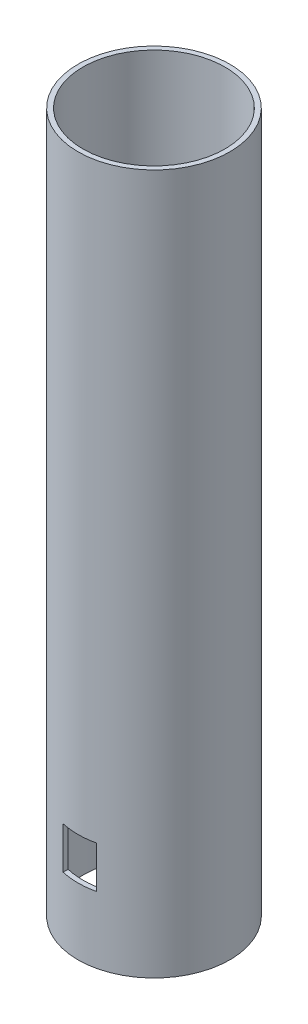
ISO-10303-21;
HEADER;
FILE_DESCRIPTION(('STEP AP214'),'2;1');
FILE_NAME('part.step','',(''),(''),'','','');
FILE_SCHEMA(('AUTOMOTIVE_DESIGN { 1 0 10303 214 1 1 1 1 }'));
ENDSEC;
DATA;
#1=APPLICATION_CONTEXT('core data for automotive mechanical design processes');
#2=APPLICATION_PROTOCOL_DEFINITION('international standard','automotive_design',2000,#1);
#3=PRODUCT_CONTEXT('',#1,'mechanical');
#4=PRODUCT('Part','Part','',(#3));
#5=PRODUCT_RELATED_PRODUCT_CATEGORY('part','',(#4));
#6=PRODUCT_DEFINITION_FORMATION('','',#4);
#7=PRODUCT_DEFINITION_CONTEXT('part definition',#1,'design');
#8=PRODUCT_DEFINITION('design','',#6,#7);
#9=PRODUCT_DEFINITION_SHAPE('','',#8);
#10=(LENGTH_UNIT() NAMED_UNIT(*) SI_UNIT(.MILLI.,.METRE.));
#11=(NAMED_UNIT(*) PLANE_ANGLE_UNIT() SI_UNIT($,.RADIAN.));
#12=(NAMED_UNIT(*) SI_UNIT($,.STERADIAN.) SOLID_ANGLE_UNIT());
#13=UNCERTAINTY_MEASURE_WITH_UNIT(LENGTH_MEASURE(1.E-05),#10,'distance_accuracy_value','');
#14=(GEOMETRIC_REPRESENTATION_CONTEXT(3) GLOBAL_UNCERTAINTY_ASSIGNED_CONTEXT((#13)) GLOBAL_UNIT_ASSIGNED_CONTEXT((#10,
#11,#12)) REPRESENTATION_CONTEXT('',''));
#15=CARTESIAN_POINT('',(0.,0.,0.));
#16=DIRECTION('',(0.,0.,1.));
#17=DIRECTION('',(1.,0.,0.));
#18=AXIS2_PLACEMENT_3D('',#15,#16,#17);
#19=CARTESIAN_POINT('',(0.,125.,0.));
#20=DIRECTION('',(0.,1.,0.));
#21=DIRECTION('',(0.,0.,1.));
#22=AXIS2_PLACEMENT_3D('',#19,#20,#21);
#23=PLANE('',#22);
#24=CARTESIAN_POINT('',(0.,125.,0.));
#25=DIRECTION('',(0.,1.,0.));
#26=DIRECTION('',(0.,0.,1.));
#27=AXIS2_PLACEMENT_3D('',#24,#25,#26);
#28=CIRCLE('',#27,27.125);
#29=CARTESIAN_POINT('',(0.,125.,27.125));
#30=VERTEX_POINT('',#29);
#31=EDGE_CURVE('E198',#30,#30,#28,.T.);
#32=ORIENTED_EDGE('',*,*,#31,.T.);
#33=EDGE_LOOP('',(#32));
#34=FACE_BOUND('',#33,.T.);
#35=CARTESIAN_POINT('',(0.,125.,0.));
#36=DIRECTION('',(0.,1.,0.));
#37=DIRECTION('',(0.,0.,1.));
#38=AXIS2_PLACEMENT_3D('',#35,#36,#37);
#39=CIRCLE('',#38,25.375);
#40=CARTESIAN_POINT('',(0.,125.,25.375));
#41=VERTEX_POINT('',#40);
#42=EDGE_CURVE('E192',#41,#41,#39,.T.);
#43=ORIENTED_EDGE('',*,*,#42,.F.);
#44=EDGE_LOOP('',(#43));
#45=FACE_BOUND('',#44,.T.);
#46=ADVANCED_FACE('F87',(#34,#45),#23,.T.);
#47=CARTESIAN_POINT('',(0.,-125.,0.));
#48=DIRECTION('',(0.,1.,0.));
#49=DIRECTION('',(0.,0.,1.));
#50=AXIS2_PLACEMENT_3D('',#47,#48,#49);
#51=PLANE('',#50);
#52=CARTESIAN_POINT('',(0.,-125.,0.));
#53=DIRECTION('',(0.,1.,0.));
#54=DIRECTION('',(0.,0.,1.));
#55=AXIS2_PLACEMENT_3D('',#52,#53,#54);
#56=CIRCLE('',#55,27.125);
#57=CARTESIAN_POINT('',(0.,-125.,27.125));
#58=VERTEX_POINT('',#57);
#59=EDGE_CURVE('E195',#58,#58,#56,.T.);
#60=ORIENTED_EDGE('',*,*,#59,.F.);
#61=EDGE_LOOP('',(#60));
#62=FACE_BOUND('',#61,.T.);
#63=CARTESIAN_POINT('',(0.,-125.,0.));
#64=DIRECTION('',(0.,1.,0.));
#65=DIRECTION('',(0.,0.,1.));
#66=AXIS2_PLACEMENT_3D('',#63,#64,#65);
#67=CIRCLE('',#66,25.375);
#68=CARTESIAN_POINT('',(0.,-125.,25.375));
#69=VERTEX_POINT('',#68);
#70=EDGE_CURVE('E191',#69,#69,#67,.T.);
#71=ORIENTED_EDGE('',*,*,#70,.T.);
#72=EDGE_LOOP('',(#71));
#73=FACE_BOUND('',#72,.T.);
#74=ADVANCED_FACE('F253',(#62,#73),#51,.F.);
#75=CARTESIAN_POINT('',(0.,125.,0.));
#76=DIRECTION('',(0.,-1.,0.));
#77=DIRECTION('',(0.,0.,-1.));
#78=AXIS2_PLACEMENT_3D('',#75,#76,#77);
#79=CYLINDRICAL_SURFACE('',#78,27.125);
#80=DIRECTION('',(0.,-1.,0.));
#81=VECTOR('',#80,1.);
#82=CARTESIAN_POINT('',(6.,125.,-26.453083468662));
#83=LINE('',#82,#81);
#84=CARTESIAN_POINT('',(6.,-101.2,-26.453083468662));
#85=VERTEX_POINT('',#84);
#86=CARTESIAN_POINT('',(6.,-86.2,-26.453083468662));
#87=VERTEX_POINT('',#86);
#88=EDGE_CURVE('E154',#85,#87,#83,.F.);
#89=ORIENTED_EDGE('',*,*,#88,.T.);
#90=CARTESIAN_POINT('',(0.,-86.2,0.));
#91=DIRECTION('',(0.,1.,0.));
#92=DIRECTION('',(0.,0.,1.));
#93=AXIS2_PLACEMENT_3D('',#90,#91,#92);
#94=CIRCLE('',#93,27.125);
#95=CARTESIAN_POINT('',(-6.,-86.2,-26.453083468662));
#96=VERTEX_POINT('',#95);
#97=EDGE_CURVE('E187',#87,#96,#94,.T.);
#98=ORIENTED_EDGE('',*,*,#97,.T.);
#99=DIRECTION('',(0.,-1.,0.));
#100=VECTOR('',#99,1.);
#101=CARTESIAN_POINT('',(-5.99999999999999,125.,-26.453083468662));
#102=LINE('',#101,#100);
#103=CARTESIAN_POINT('',(-6.,-101.2,-26.453083468662));
#104=VERTEX_POINT('',#103);
#105=EDGE_CURVE('E156',#96,#104,#102,.T.);
#106=ORIENTED_EDGE('',*,*,#105,.T.);
#107=CARTESIAN_POINT('',(0.,-101.2,0.));
#108=DIRECTION('',(0.,-1.,0.));
#109=DIRECTION('',(0.,0.,-1.));
#110=AXIS2_PLACEMENT_3D('',#107,#108,#109);
#111=CIRCLE('',#110,27.125);
#112=EDGE_CURVE('E152',#104,#85,#111,.T.);
#113=ORIENTED_EDGE('',*,*,#112,.T.);
#114=EDGE_LOOP('',(#89,#98,#106,#113));
#115=FACE_BOUND('',#114,.T.);
#116=CARTESIAN_POINT('',(-6.,-86.2,26.453083468662));
#117=VERTEX_POINT('',#116);
#118=CARTESIAN_POINT('',(6.,-86.2,26.453083468662));
#119=VERTEX_POINT('',#118);
#120=EDGE_CURVE('E185',#117,#119,#94,.T.);
#121=ORIENTED_EDGE('',*,*,#120,.T.);
#122=DIRECTION('',(0.,-1.,0.));
#123=VECTOR('',#122,1.);
#124=CARTESIAN_POINT('',(6.,125.,26.453083468662));
#125=LINE('',#124,#123);
#126=CARTESIAN_POINT('',(6.,-101.2,26.453083468662));
#127=VERTEX_POINT('',#126);
#128=EDGE_CURVE('E170',#119,#127,#125,.T.);
#129=ORIENTED_EDGE('',*,*,#128,.T.);
#130=CARTESIAN_POINT('',(-6.,-101.2,26.453083468662));
#131=VERTEX_POINT('',#130);
#132=EDGE_CURVE('E102',#127,#131,#111,.T.);
#133=ORIENTED_EDGE('',*,*,#132,.T.);
#134=DIRECTION('',(0.,-1.,0.));
#135=VECTOR('',#134,1.);
#136=CARTESIAN_POINT('',(-5.99999999999999,125.,26.453083468662));
#137=LINE('',#136,#135);
#138=EDGE_CURVE('E188',#131,#117,#137,.F.);
#139=ORIENTED_EDGE('',*,*,#138,.T.);
#140=EDGE_LOOP('',(#121,#129,#133,#139));
#141=FACE_BOUND('',#140,.T.);
#142=ORIENTED_EDGE('',*,*,#31,.F.);
#143=EDGE_LOOP('',(#142));
#144=FACE_BOUND('',#143,.T.);
#145=ORIENTED_EDGE('',*,*,#59,.T.);
#146=EDGE_LOOP('',(#145));
#147=FACE_BOUND('',#146,.T.);
#148=ADVANCED_FACE('F89',(#115,#141,#144,#147),#79,.T.);
#149=CARTESIAN_POINT('',(0.,125.,0.));
#150=DIRECTION('',(0.,-1.,0.));
#151=DIRECTION('',(0.,0.,-1.));
#152=AXIS2_PLACEMENT_3D('',#149,#150,#151);
#153=CYLINDRICAL_SURFACE('',#152,25.375);
#154=DIRECTION('',(0.,-1.,0.));
#155=VECTOR('',#154,1.);
#156=CARTESIAN_POINT('',(-5.99999999999999,125.,24.65543804113));
#157=LINE('',#156,#155);
#158=CARTESIAN_POINT('',(-6.,-101.2,24.65543804113));
#159=VERTEX_POINT('',#158);
#160=CARTESIAN_POINT('',(-6.,-86.2,24.65543804113));
#161=VERTEX_POINT('',#160);
#162=EDGE_CURVE('E12',#159,#161,#157,.F.);
#163=ORIENTED_EDGE('',*,*,#162,.F.);
#164=CARTESIAN_POINT('',(0.,-101.2,0.));
#165=DIRECTION('',(0.,-1.,0.));
#166=DIRECTION('',(0.,0.,-1.));
#167=AXIS2_PLACEMENT_3D('',#164,#165,#166);
#168=CIRCLE('',#167,25.375);
#169=CARTESIAN_POINT('',(6.,-101.2,24.65543804113));
#170=VERTEX_POINT('',#169);
#171=EDGE_CURVE('E205',#170,#159,#168,.T.);
#172=ORIENTED_EDGE('',*,*,#171,.F.);
#173=DIRECTION('',(0.,-1.,0.));
#174=VECTOR('',#173,1.);
#175=CARTESIAN_POINT('',(6.,125.,24.65543804113));
#176=LINE('',#175,#174);
#177=CARTESIAN_POINT('',(6.,-86.2,24.65543804113));
#178=VERTEX_POINT('',#177);
#179=EDGE_CURVE('E211',#178,#170,#176,.T.);
#180=ORIENTED_EDGE('',*,*,#179,.F.);
#181=CARTESIAN_POINT('',(0.,-86.2,0.));
#182=DIRECTION('',(0.,1.,0.));
#183=DIRECTION('',(0.,0.,1.));
#184=AXIS2_PLACEMENT_3D('',#181,#182,#183);
#185=CIRCLE('',#184,25.375);
#186=EDGE_CURVE('E95',#161,#178,#185,.T.);
#187=ORIENTED_EDGE('',*,*,#186,.F.);
#188=EDGE_LOOP('',(#163,#172,#180,#187));
#189=FACE_BOUND('',#188,.T.);
#190=DIRECTION('',(0.,-1.,0.));
#191=VECTOR('',#190,1.);
#192=CARTESIAN_POINT('',(-5.99999999999999,125.,-24.65543804113));
#193=LINE('',#192,#191);
#194=CARTESIAN_POINT('',(-6.,-86.2,-24.65543804113));
#195=VERTEX_POINT('',#194);
#196=CARTESIAN_POINT('',(-6.,-101.2,-24.65543804113));
#197=VERTEX_POINT('',#196);
#198=EDGE_CURVE('E209',#195,#197,#193,.T.);
#199=ORIENTED_EDGE('',*,*,#198,.F.);
#200=CARTESIAN_POINT('',(6.,-86.2,-24.65543804113));
#201=VERTEX_POINT('',#200);
#202=EDGE_CURVE('E207',#201,#195,#185,.T.);
#203=ORIENTED_EDGE('',*,*,#202,.F.);
#204=DIRECTION('',(0.,-1.,0.));
#205=VECTOR('',#204,1.);
#206=CARTESIAN_POINT('',(6.,125.,-24.65543804113));
#207=LINE('',#206,#205);
#208=CARTESIAN_POINT('',(6.,-101.2,-24.65543804113));
#209=VERTEX_POINT('',#208);
#210=EDGE_CURVE('E204',#209,#201,#207,.F.);
#211=ORIENTED_EDGE('',*,*,#210,.F.);
#212=EDGE_CURVE('E174',#197,#209,#168,.T.);
#213=ORIENTED_EDGE('',*,*,#212,.F.);
#214=EDGE_LOOP('',(#199,#203,#211,#213));
#215=FACE_BOUND('',#214,.T.);
#216=ORIENTED_EDGE('',*,*,#42,.T.);
#217=EDGE_LOOP('',(#216));
#218=FACE_BOUND('',#217,.T.);
#219=ORIENTED_EDGE('',*,*,#70,.F.);
#220=EDGE_LOOP('',(#219));
#221=FACE_BOUND('',#220,.T.);
#222=ADVANCED_FACE('F226',(#189,#215,#218,#221),#153,.F.);
#223=CARTESIAN_POINT('',(-6.,-101.2,-27.125));
#224=DIRECTION('',(0.,-1.,0.));
#225=DIRECTION('',(0.,0.,-1.));
#226=AXIS2_PLACEMENT_3D('',#223,#224,#225);
#227=PLANE('',#226);
#228=ORIENTED_EDGE('',*,*,#112,.F.);
#229=DIRECTION('',(0.,0.,1.));
#230=VECTOR('',#229,1.);
#231=CARTESIAN_POINT('',(-6.,-101.2,-27.125));
#232=LINE('',#231,#230);
#233=EDGE_CURVE('E179',#104,#197,#232,.T.);
#234=ORIENTED_EDGE('',*,*,#233,.T.);
#235=ORIENTED_EDGE('',*,*,#212,.T.);
#236=DIRECTION('',(0.,0.,1.));
#237=VECTOR('',#236,1.);
#238=CARTESIAN_POINT('',(6.,-101.2,-27.125));
#239=LINE('',#238,#237);
#240=EDGE_CURVE('E166',#85,#209,#239,.T.);
#241=ORIENTED_EDGE('',*,*,#240,.F.);
#242=EDGE_LOOP('',(#228,#234,#235,#241));
#243=FACE_BOUND('',#242,.T.);
#244=ADVANCED_FACE('F172',(#243),#227,.F.);
#245=CARTESIAN_POINT('',(6.,-101.2,-27.125));
#246=DIRECTION('',(1.,0.,0.));
#247=DIRECTION('',(0.,0.,-1.));
#248=AXIS2_PLACEMENT_3D('',#245,#246,#247);
#249=PLANE('',#248);
#250=ORIENTED_EDGE('',*,*,#240,.T.);
#251=ORIENTED_EDGE('',*,*,#210,.T.);
#252=DIRECTION('',(0.,0.,1.));
#253=VECTOR('',#252,1.);
#254=CARTESIAN_POINT('',(6.,-86.2,-27.125));
#255=LINE('',#254,#253);
#256=EDGE_CURVE('E169',#87,#201,#255,.T.);
#257=ORIENTED_EDGE('',*,*,#256,.F.);
#258=ORIENTED_EDGE('',*,*,#88,.F.);
#259=EDGE_LOOP('',(#250,#251,#257,#258));
#260=FACE_BOUND('',#259,.T.);
#261=ADVANCED_FACE('F165',(#260),#249,.F.);
#262=CARTESIAN_POINT('',(-6.,-86.2,-27.125));
#263=DIRECTION('',(0.,1.,0.));
#264=DIRECTION('',(0.,0.,1.));
#265=AXIS2_PLACEMENT_3D('',#262,#263,#264);
#266=PLANE('',#265);
#267=ORIENTED_EDGE('',*,*,#256,.T.);
#268=ORIENTED_EDGE('',*,*,#202,.T.);
#269=DIRECTION('',(0.,0.,1.));
#270=VECTOR('',#269,1.);
#271=CARTESIAN_POINT('',(-6.,-86.2,-27.125));
#272=LINE('',#271,#270);
#273=EDGE_CURVE('E160',#96,#195,#272,.T.);
#274=ORIENTED_EDGE('',*,*,#273,.F.);
#275=ORIENTED_EDGE('',*,*,#97,.F.);
#276=EDGE_LOOP('',(#267,#268,#274,#275));
#277=FACE_BOUND('',#276,.T.);
#278=ADVANCED_FACE('F237',(#277),#266,.F.);
#279=CARTESIAN_POINT('',(-6.,-101.2,-27.125));
#280=DIRECTION('',(-1.,0.,0.));
#281=DIRECTION('',(0.,-1.,0.));
#282=AXIS2_PLACEMENT_3D('',#279,#280,#281);
#283=PLANE('',#282);
#284=ORIENTED_EDGE('',*,*,#273,.T.);
#285=ORIENTED_EDGE('',*,*,#198,.T.);
#286=ORIENTED_EDGE('',*,*,#233,.F.);
#287=ORIENTED_EDGE('',*,*,#105,.F.);
#288=EDGE_LOOP('',(#284,#285,#286,#287));
#289=FACE_BOUND('',#288,.T.);
#290=ADVANCED_FACE('F242',(#289),#283,.F.);
#291=EDGE_CURVE('E182',#159,#131,#232,.T.);
#292=ORIENTED_EDGE('',*,*,#291,.F.);
#293=ORIENTED_EDGE('',*,*,#162,.T.);
#294=EDGE_CURVE('E230',#161,#117,#272,.T.);
#295=ORIENTED_EDGE('',*,*,#294,.T.);
#296=ORIENTED_EDGE('',*,*,#138,.F.);
#297=EDGE_LOOP('',(#292,#293,#295,#296));
#298=FACE_BOUND('',#297,.T.);
#299=ADVANCED_FACE('F222',(#298),#283,.F.);
#300=ORIENTED_EDGE('',*,*,#120,.F.);
#301=ORIENTED_EDGE('',*,*,#294,.F.);
#302=ORIENTED_EDGE('',*,*,#186,.T.);
#303=EDGE_CURVE('E175',#178,#119,#255,.T.);
#304=ORIENTED_EDGE('',*,*,#303,.T.);
#305=EDGE_LOOP('',(#300,#301,#302,#304));
#306=FACE_BOUND('',#305,.T.);
#307=ADVANCED_FACE('F229',(#306),#266,.F.);
#308=ORIENTED_EDGE('',*,*,#303,.F.);
#309=ORIENTED_EDGE('',*,*,#179,.T.);
#310=EDGE_CURVE('E109',#170,#127,#239,.T.);
#311=ORIENTED_EDGE('',*,*,#310,.T.);
#312=ORIENTED_EDGE('',*,*,#128,.F.);
#313=EDGE_LOOP('',(#308,#309,#311,#312));
#314=FACE_BOUND('',#313,.T.);
#315=ADVANCED_FACE('F232',(#314),#249,.F.);
#316=ORIENTED_EDGE('',*,*,#310,.F.);
#317=ORIENTED_EDGE('',*,*,#171,.T.);
#318=ORIENTED_EDGE('',*,*,#291,.T.);
#319=ORIENTED_EDGE('',*,*,#132,.F.);
#320=EDGE_LOOP('',(#316,#317,#318,#319));
#321=FACE_BOUND('',#320,.T.);
#322=ADVANCED_FACE('F217',(#321),#227,.F.);
#323=CLOSED_SHELL('',(#46,#74,#148,#222,#244,#261,#278,#290,#299,#307,#315,#322));
#324=MANIFOLD_SOLID_BREP('B2',#323);
#325=ADVANCED_BREP_SHAPE_REPRESENTATION('',(#18,#324),#14);
#326=SHAPE_DEFINITION_REPRESENTATION(#9,#325);
ENDSEC;
END-ISO-10303-21;
